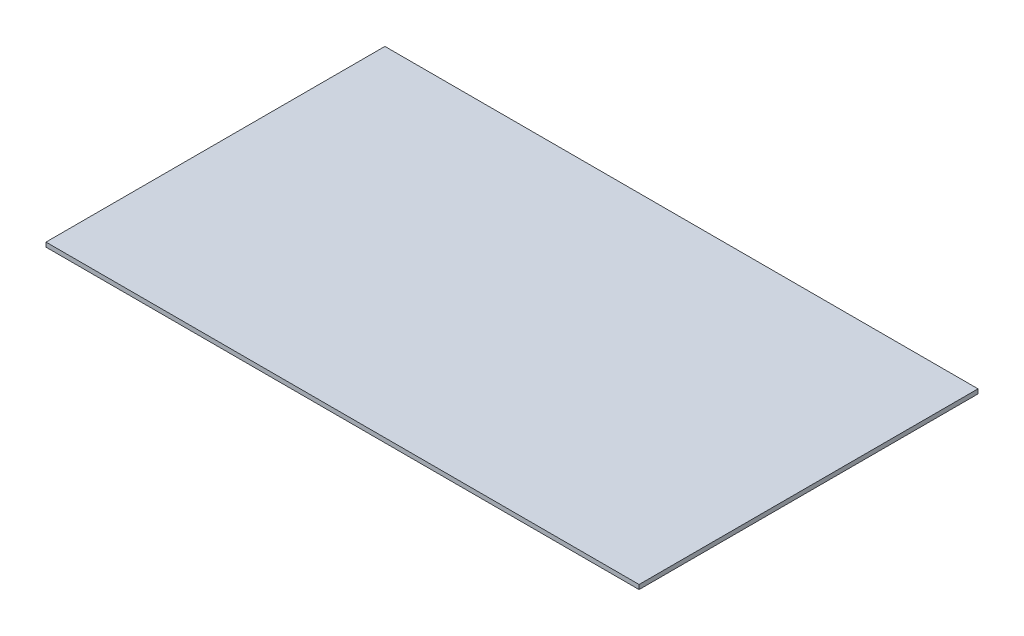
ISO-10303-21;
HEADER;
FILE_DESCRIPTION(('STEP AP214'),'2;1');
FILE_NAME('part.step','',(''),(''),'','','');
FILE_SCHEMA(('AUTOMOTIVE_DESIGN { 1 0 10303 214 1 1 1 1 }'));
ENDSEC;
DATA;
#1=APPLICATION_CONTEXT('core data for automotive mechanical design processes');
#2=APPLICATION_PROTOCOL_DEFINITION('international standard','automotive_design',2000,#1);
#3=PRODUCT_CONTEXT('',#1,'mechanical');
#4=PRODUCT('Part','Part','',(#3));
#5=PRODUCT_RELATED_PRODUCT_CATEGORY('part','',(#4));
#6=PRODUCT_DEFINITION_FORMATION('','',#4);
#7=PRODUCT_DEFINITION_CONTEXT('part definition',#1,'design');
#8=PRODUCT_DEFINITION('design','',#6,#7);
#9=PRODUCT_DEFINITION_SHAPE('','',#8);
#10=(LENGTH_UNIT() NAMED_UNIT(*) SI_UNIT(.MILLI.,.METRE.));
#11=(NAMED_UNIT(*) PLANE_ANGLE_UNIT() SI_UNIT($,.RADIAN.));
#12=(NAMED_UNIT(*) SI_UNIT($,.STERADIAN.) SOLID_ANGLE_UNIT());
#13=UNCERTAINTY_MEASURE_WITH_UNIT(LENGTH_MEASURE(1.E-05),#10,'distance_accuracy_value','');
#14=(GEOMETRIC_REPRESENTATION_CONTEXT(3) GLOBAL_UNCERTAINTY_ASSIGNED_CONTEXT((#13)) GLOBAL_UNIT_ASSIGNED_CONTEXT((#10,
#11,#12)) REPRESENTATION_CONTEXT('',''));
#15=CARTESIAN_POINT('',(0.,0.,0.));
#16=DIRECTION('',(0.,0.,1.));
#17=DIRECTION('',(1.,0.,0.));
#18=AXIS2_PLACEMENT_3D('',#15,#16,#17);
#19=CARTESIAN_POINT('',(0.,-2.65684,0.));
#20=DIRECTION('',(-1.,0.,0.));
#21=DIRECTION('',(0.,0.,1.));
#22=AXIS2_PLACEMENT_3D('',#19,#20,#21);
#23=PLANE('',#22);
#24=DIRECTION('',(0.,0.,1.));
#25=VECTOR('',#24,1.);
#26=CARTESIAN_POINT('',(0.,0.,0.));
#27=LINE('',#26,#25);
#28=CARTESIAN_POINT('',(0.,0.,-203.2));
#29=VERTEX_POINT('',#28);
#30=CARTESIAN_POINT('',(0.,0.,0.));
#31=VERTEX_POINT('',#30);
#32=EDGE_CURVE('E102',#29,#31,#27,.T.);
#33=ORIENTED_EDGE('',*,*,#32,.F.);
#34=DIRECTION('',(0.,1.,0.));
#35=VECTOR('',#34,1.);
#36=CARTESIAN_POINT('',(0.,-2.65684,-203.2));
#37=LINE('',#36,#35);
#38=CARTESIAN_POINT('',(0.,-2.65684,-203.2));
#39=VERTEX_POINT('',#38);
#40=EDGE_CURVE('E11',#39,#29,#37,.T.);
#41=ORIENTED_EDGE('',*,*,#40,.F.);
#42=DIRECTION('',(0.,0.,1.));
#43=VECTOR('',#42,1.);
#44=CARTESIAN_POINT('',(0.,-2.65684,0.));
#45=LINE('',#44,#43);
#46=CARTESIAN_POINT('',(0.,-2.65684,0.));
#47=VERTEX_POINT('',#46);
#48=EDGE_CURVE('E96',#39,#47,#45,.T.);
#49=ORIENTED_EDGE('',*,*,#48,.T.);
#50=DIRECTION('',(0.,1.,0.));
#51=VECTOR('',#50,1.);
#52=CARTESIAN_POINT('',(0.,-2.65684,0.));
#53=LINE('',#52,#51);
#54=EDGE_CURVE('E41',#47,#31,#53,.T.);
#55=ORIENTED_EDGE('',*,*,#54,.T.);
#56=EDGE_LOOP('',(#33,#41,#49,#55));
#57=FACE_BOUND('',#56,.T.);
#58=ADVANCED_FACE('F38',(#57),#23,.T.);
#59=CARTESIAN_POINT('',(0.,-2.65684,-203.2));
#60=DIRECTION('',(0.,0.,-1.));
#61=DIRECTION('',(-1.,0.,0.));
#62=AXIS2_PLACEMENT_3D('',#59,#60,#61);
#63=PLANE('',#62);
#64=DIRECTION('',(-1.,0.,0.));
#65=VECTOR('',#64,1.);
#66=CARTESIAN_POINT('',(0.,0.,-203.2));
#67=LINE('',#66,#65);
#68=CARTESIAN_POINT('',(355.6,0.,-203.2));
#69=VERTEX_POINT('',#68);
#70=EDGE_CURVE('E98',#69,#29,#67,.T.);
#71=ORIENTED_EDGE('',*,*,#70,.F.);
#72=DIRECTION('',(0.,1.,0.));
#73=VECTOR('',#72,1.);
#74=CARTESIAN_POINT('',(355.6,-2.65684,-203.2));
#75=LINE('',#74,#73);
#76=CARTESIAN_POINT('',(355.6,-2.65684,-203.2));
#77=VERTEX_POINT('',#76);
#78=EDGE_CURVE('E47',#77,#69,#75,.T.);
#79=ORIENTED_EDGE('',*,*,#78,.F.);
#80=DIRECTION('',(-1.,0.,0.));
#81=VECTOR('',#80,1.);
#82=CARTESIAN_POINT('',(0.,-2.65684,-203.2));
#83=LINE('',#82,#81);
#84=EDGE_CURVE('E93',#77,#39,#83,.T.);
#85=ORIENTED_EDGE('',*,*,#84,.T.);
#86=ORIENTED_EDGE('',*,*,#40,.T.);
#87=EDGE_LOOP('',(#71,#79,#85,#86));
#88=FACE_BOUND('',#87,.T.);
#89=ADVANCED_FACE('F112',(#88),#63,.T.);
#90=CARTESIAN_POINT('',(355.6,-2.65684,0.));
#91=DIRECTION('',(1.,0.,0.));
#92=DIRECTION('',(0.,0.,-1.));
#93=AXIS2_PLACEMENT_3D('',#90,#91,#92);
#94=PLANE('',#93);
#95=DIRECTION('',(0.,0.,-1.));
#96=VECTOR('',#95,1.);
#97=CARTESIAN_POINT('',(355.6,0.,0.));
#98=LINE('',#97,#96);
#99=CARTESIAN_POINT('',(355.6,0.,0.));
#100=VERTEX_POINT('',#99);
#101=EDGE_CURVE('E88',#100,#69,#98,.T.);
#102=ORIENTED_EDGE('',*,*,#101,.F.);
#103=DIRECTION('',(0.,1.,0.));
#104=VECTOR('',#103,1.);
#105=CARTESIAN_POINT('',(355.6,-2.65684,0.));
#106=LINE('',#105,#104);
#107=CARTESIAN_POINT('',(355.6,-2.65684,0.));
#108=VERTEX_POINT('',#107);
#109=EDGE_CURVE('E83',#108,#100,#106,.T.);
#110=ORIENTED_EDGE('',*,*,#109,.F.);
#111=DIRECTION('',(0.,0.,-1.));
#112=VECTOR('',#111,1.);
#113=CARTESIAN_POINT('',(355.6,-2.65684,0.));
#114=LINE('',#113,#112);
#115=EDGE_CURVE('E86',#108,#77,#114,.T.);
#116=ORIENTED_EDGE('',*,*,#115,.T.);
#117=ORIENTED_EDGE('',*,*,#78,.T.);
#118=EDGE_LOOP('',(#102,#110,#116,#117));
#119=FACE_BOUND('',#118,.T.);
#120=ADVANCED_FACE('F85',(#119),#94,.T.);
#121=CARTESIAN_POINT('',(0.,-2.65684,0.));
#122=DIRECTION('',(0.,0.,1.));
#123=DIRECTION('',(1.,0.,0.));
#124=AXIS2_PLACEMENT_3D('',#121,#122,#123);
#125=PLANE('',#124);
#126=DIRECTION('',(1.,0.,0.));
#127=VECTOR('',#126,1.);
#128=CARTESIAN_POINT('',(0.,0.,0.));
#129=LINE('',#128,#127);
#130=EDGE_CURVE('E105',#31,#100,#129,.T.);
#131=ORIENTED_EDGE('',*,*,#130,.F.);
#132=ORIENTED_EDGE('',*,*,#54,.F.);
#133=DIRECTION('',(1.,0.,0.));
#134=VECTOR('',#133,1.);
#135=CARTESIAN_POINT('',(0.,-2.65684,0.));
#136=LINE('',#135,#134);
#137=EDGE_CURVE('E92',#47,#108,#136,.T.);
#138=ORIENTED_EDGE('',*,*,#137,.T.);
#139=ORIENTED_EDGE('',*,*,#109,.T.);
#140=EDGE_LOOP('',(#131,#132,#138,#139));
#141=FACE_BOUND('',#140,.T.);
#142=ADVANCED_FACE('F95',(#141),#125,.T.);
#143=CARTESIAN_POINT('',(0.,-2.65684,0.));
#144=DIRECTION('',(0.,-1.,0.));
#145=DIRECTION('',(0.,0.,-1.));
#146=AXIS2_PLACEMENT_3D('',#143,#144,#145);
#147=PLANE('',#146);
#148=ORIENTED_EDGE('',*,*,#48,.F.);
#149=ORIENTED_EDGE('',*,*,#84,.F.);
#150=ORIENTED_EDGE('',*,*,#115,.F.);
#151=ORIENTED_EDGE('',*,*,#137,.F.);
#152=EDGE_LOOP('',(#148,#149,#150,#151));
#153=FACE_BOUND('',#152,.T.);
#154=ADVANCED_FACE('F91',(#153),#147,.T.);
#155=CARTESIAN_POINT('',(0.,0.,0.));
#156=DIRECTION('',(0.,-1.,0.));
#157=DIRECTION('',(0.,0.,-1.));
#158=AXIS2_PLACEMENT_3D('',#155,#156,#157);
#159=PLANE('',#158);
#160=ORIENTED_EDGE('',*,*,#32,.T.);
#161=ORIENTED_EDGE('',*,*,#130,.T.);
#162=ORIENTED_EDGE('',*,*,#101,.T.);
#163=ORIENTED_EDGE('',*,*,#70,.T.);
#164=EDGE_LOOP('',(#160,#161,#162,#163));
#165=FACE_BOUND('',#164,.T.);
#166=ADVANCED_FACE('F111',(#165),#159,.F.);
#167=CLOSED_SHELL('',(#58,#89,#120,#142,#154,#166));
#168=MANIFOLD_SOLID_BREP('B2',#167);
#169=ADVANCED_BREP_SHAPE_REPRESENTATION('',(#18,#168),#14);
#170=SHAPE_DEFINITION_REPRESENTATION(#9,#169);
ENDSEC;
END-ISO-10303-21;
